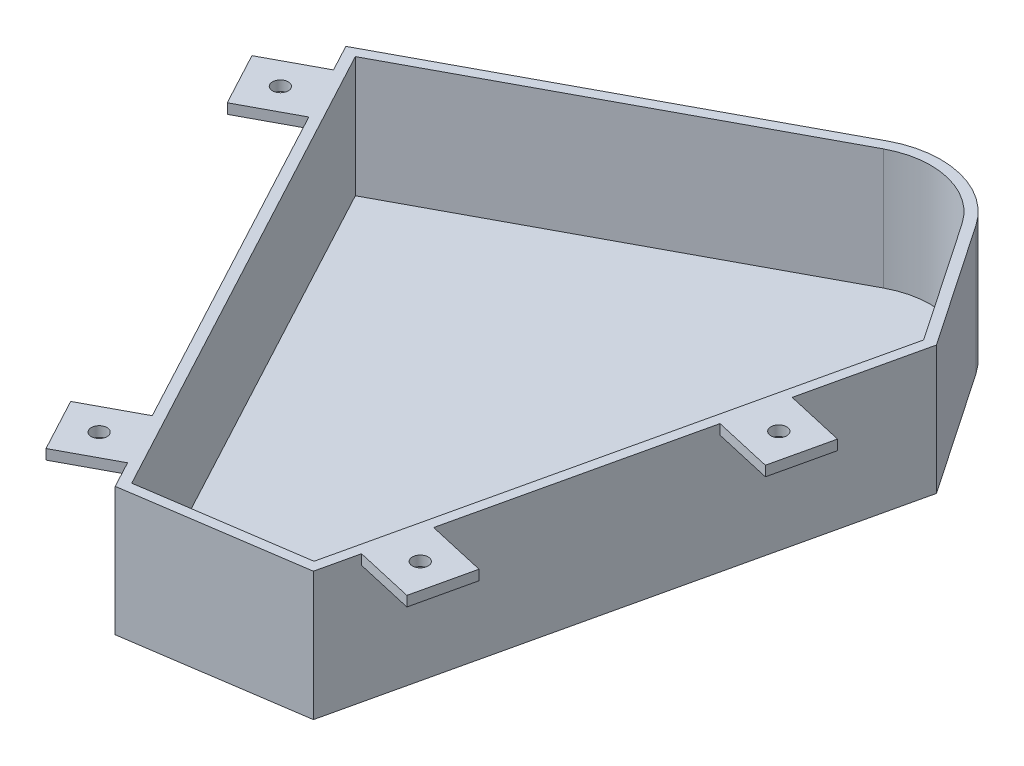
ISO-10303-21;
HEADER;
FILE_DESCRIPTION(('STEP AP214'),'2;1');
FILE_NAME('part.step','',(''),(''),'','','');
FILE_SCHEMA(('AUTOMOTIVE_DESIGN { 1 0 10303 214 1 1 1 1 }'));
ENDSEC;
DATA;
#1=APPLICATION_CONTEXT('core data for automotive mechanical design processes');
#2=APPLICATION_PROTOCOL_DEFINITION('international standard','automotive_design',2000,#1);
#3=PRODUCT_CONTEXT('',#1,'mechanical');
#4=PRODUCT('Part','Part','',(#3));
#5=PRODUCT_RELATED_PRODUCT_CATEGORY('part','',(#4));
#6=PRODUCT_DEFINITION_FORMATION('','',#4);
#7=PRODUCT_DEFINITION_CONTEXT('part definition',#1,'design');
#8=PRODUCT_DEFINITION('design','',#6,#7);
#9=PRODUCT_DEFINITION_SHAPE('','',#8);
#10=(LENGTH_UNIT() NAMED_UNIT(*) SI_UNIT(.MILLI.,.METRE.));
#11=(NAMED_UNIT(*) PLANE_ANGLE_UNIT() SI_UNIT($,.RADIAN.));
#12=(NAMED_UNIT(*) SI_UNIT($,.STERADIAN.) SOLID_ANGLE_UNIT());
#13=UNCERTAINTY_MEASURE_WITH_UNIT(LENGTH_MEASURE(1.E-05),#10,'distance_accuracy_value','');
#14=(GEOMETRIC_REPRESENTATION_CONTEXT(3) GLOBAL_UNCERTAINTY_ASSIGNED_CONTEXT((#13)) GLOBAL_UNIT_ASSIGNED_CONTEXT((#10,
#11,#12)) REPRESENTATION_CONTEXT('',''));
#15=CARTESIAN_POINT('',(0.,0.,0.));
#16=DIRECTION('',(0.,0.,1.));
#17=DIRECTION('',(1.,0.,0.));
#18=AXIS2_PLACEMENT_3D('',#15,#16,#17);
#19=CARTESIAN_POINT('',(79.6910894565371,-281.142833889522,155.590310015721));
#20=DIRECTION('',(-0.881620360618807,0.,0.471959256443143));
#21=DIRECTION('',(0.471959256443143,0.,0.881620360618807));
#22=AXIS2_PLACEMENT_3D('',#19,#20,#21);
#23=PLANE('',#22);
#24=DIRECTION('',(0.471959256443143,0.,0.881620360618807));
#25=VECTOR('',#24,1.);
#26=CARTESIAN_POINT('',(79.6910894565371,40.64,155.590310015721));
#27=LINE('',#26,#25);
#28=CARTESIAN_POINT('',(75.1956775389162,40.64,147.192876080827));
#29=VERTEX_POINT('',#28);
#30=CARTESIAN_POINT('',(79.6910894565371,40.64,155.590310015721));
#31=VERTEX_POINT('',#30);
#32=EDGE_CURVE('E359',#29,#31,#27,.T.);
#33=ORIENTED_EDGE('',*,*,#32,.F.);
#34=DIRECTION('',(0.,1.,0.));
#35=VECTOR('',#34,1.);
#36=CARTESIAN_POINT('',(75.1956775389161,40.64,147.192876080827));
#37=LINE('',#36,#35);
#38=CARTESIAN_POINT('',(75.1956775389161,37.465,147.192876080827));
#39=VERTEX_POINT('',#38);
#40=EDGE_CURVE('E50',#39,#29,#37,.T.);
#41=ORIENTED_EDGE('',*,*,#40,.F.);
#42=DIRECTION('',(0.471959256443143,0.,0.881620360618807));
#43=VECTOR('',#42,1.);
#44=CARTESIAN_POINT('',(75.1956775389161,37.465,147.192876080827));
#45=LINE('',#44,#43);
#46=CARTESIAN_POINT('',(66.2048537036742,37.465,130.398008211039));
#47=VERTEX_POINT('',#46);
#48=EDGE_CURVE('E240',#47,#39,#45,.T.);
#49=ORIENTED_EDGE('',*,*,#48,.F.);
#50=DIRECTION('',(0.,-1.,0.));
#51=VECTOR('',#50,1.);
#52=CARTESIAN_POINT('',(66.2048537036742,40.64,130.398008211039));
#53=LINE('',#52,#51);
#54=CARTESIAN_POINT('',(66.2048537036742,40.64,130.398008211039));
#55=VERTEX_POINT('',#54);
#56=EDGE_CURVE('E774',#55,#47,#53,.T.);
#57=ORIENTED_EDGE('',*,*,#56,.F.);
#58=CARTESIAN_POINT('',(9.18862046869114,40.64,23.8916277989247));
#59=VERTEX_POINT('',#58);
#60=EDGE_CURVE('E364',#59,#55,#27,.T.);
#61=ORIENTED_EDGE('',*,*,#60,.F.);
#62=DIRECTION('',(0.,1.,0.));
#63=VECTOR('',#62,1.);
#64=CARTESIAN_POINT('',(9.18862046869111,40.64,23.8916277989247));
#65=LINE('',#64,#63);
#66=CARTESIAN_POINT('',(9.18862046869111,37.465,23.8916277989247));
#67=VERTEX_POINT('',#66);
#68=EDGE_CURVE('E256',#67,#59,#65,.T.);
#69=ORIENTED_EDGE('',*,*,#68,.F.);
#70=DIRECTION('',(0.471959256443142,0.,0.881620360618808));
#71=VECTOR('',#70,1.);
#72=CARTESIAN_POINT('',(0.197796633449249,37.465,7.09675992913642));
#73=LINE('',#72,#71);
#74=CARTESIAN_POINT('',(0.197796633449249,37.465,7.09675992913642));
#75=VERTEX_POINT('',#74);
#76=EDGE_CURVE('E246',#75,#67,#73,.T.);
#77=ORIENTED_EDGE('',*,*,#76,.F.);
#78=DIRECTION('',(0.,-1.,0.));
#79=VECTOR('',#78,1.);
#80=CARTESIAN_POINT('',(0.19779663344925,40.64,7.09675992913642));
#81=LINE('',#80,#79);
#82=CARTESIAN_POINT('',(0.19779663344925,40.64,7.09675992913642));
#83=VERTEX_POINT('',#82);
#84=EDGE_CURVE('E243',#83,#75,#81,.T.);
#85=ORIENTED_EDGE('',*,*,#84,.F.);
#86=CARTESIAN_POINT('',(-4.29761528417168,40.64,-1.30067400575773));
#87=VERTEX_POINT('',#86);
#88=EDGE_CURVE('E360',#87,#83,#27,.T.);
#89=ORIENTED_EDGE('',*,*,#88,.F.);
#90=DIRECTION('',(0.,1.,0.));
#91=VECTOR('',#90,1.);
#92=CARTESIAN_POINT('',(-4.29761528417168,-281.142833889522,-1.30067400575773));
#93=LINE('',#92,#91);
#94=CARTESIAN_POINT('',(-4.29761528417168,0.,-1.30067400575773));
#95=VERTEX_POINT('',#94);
#96=EDGE_CURVE('E393',#95,#87,#93,.T.);
#97=ORIENTED_EDGE('',*,*,#96,.F.);
#98=DIRECTION('',(-0.471959256443143,0.,-0.881620360618807));
#99=VECTOR('',#98,1.);
#100=CARTESIAN_POINT('',(79.6910894565371,0.,155.590310015721));
#101=LINE('',#100,#99);
#102=CARTESIAN_POINT('',(79.6910894565371,0.,155.590310015721));
#103=VERTEX_POINT('',#102);
#104=EDGE_CURVE('E376',#103,#95,#101,.T.);
#105=ORIENTED_EDGE('',*,*,#104,.F.);
#106=DIRECTION('',(0.,1.,0.));
#107=VECTOR('',#106,1.);
#108=CARTESIAN_POINT('',(79.6910894565371,-281.142833889522,155.590310015721));
#109=LINE('',#108,#107);
#110=EDGE_CURVE('E372',#103,#31,#109,.T.);
#111=ORIENTED_EDGE('',*,*,#110,.T.);
#112=EDGE_LOOP('',(#33,#41,#49,#57,#61,#69,#77,#85,#89,#97,#105,#111));
#113=FACE_BOUND('',#112,.T.);
#114=ADVANCED_FACE('F35',(#113),#23,.T.);
#115=CARTESIAN_POINT('',(170.799497483055,-281.142833889522,-12.8953047442904));
#116=DIRECTION('',(0.975001962576884,0.,0.222196248778473));
#117=DIRECTION('',(0.222196248778473,0.,-0.975001962576884));
#118=AXIS2_PLACEMENT_3D('',#115,#116,#117);
#119=PLANE('',#118);
#120=DIRECTION('',(0.222196248778473,0.,-0.975001962576884));
#121=VECTOR('',#120,1.);
#122=CARTESIAN_POINT('',(170.799497483055,40.64,-12.8953047442904));
#123=LINE('',#122,#121);
#124=CARTESIAN_POINT('',(141.301647358276,40.64,116.541901876294));
#125=VERTEX_POINT('',#124);
#126=CARTESIAN_POINT('',(158.100981865365,40.64,42.8260574169785));
#127=VERTEX_POINT('',#126);
#128=EDGE_CURVE('E350',#125,#127,#123,.T.);
#129=ORIENTED_EDGE('',*,*,#128,.F.);
#130=DIRECTION('',(0.,1.,0.));
#131=VECTOR('',#130,1.);
#132=CARTESIAN_POINT('',(141.301647358276,40.64,116.541901876294));
#133=LINE('',#132,#131);
#134=CARTESIAN_POINT('',(141.301647358276,37.465,116.541901876294));
#135=VERTEX_POINT('',#134);
#136=EDGE_CURVE('E272',#135,#125,#133,.T.);
#137=ORIENTED_EDGE('',*,*,#136,.F.);
#138=DIRECTION('',(0.222196248778474,0.,-0.975001962576884));
#139=VECTOR('',#138,1.);
#140=CARTESIAN_POINT('',(141.301647358276,37.465,116.541901876294));
#141=LINE('',#140,#139);
#142=CARTESIAN_POINT('',(137.068808819046,37.465,135.115689263384));
#143=VERTEX_POINT('',#142);
#144=EDGE_CURVE('E277',#143,#135,#141,.T.);
#145=ORIENTED_EDGE('',*,*,#144,.F.);
#146=DIRECTION('',(0.,-1.,0.));
#147=VECTOR('',#146,1.);
#148=CARTESIAN_POINT('',(137.068808819046,40.64,135.115689263384));
#149=LINE('',#148,#147);
#150=CARTESIAN_POINT('',(137.068808819046,40.64,135.115689263384));
#151=VERTEX_POINT('',#150);
#152=EDGE_CURVE('E285',#151,#143,#149,.T.);
#153=ORIENTED_EDGE('',*,*,#152,.F.);
#154=CARTESIAN_POINT('',(134.24691645956,40.64,147.49821418811));
#155=VERTEX_POINT('',#154);
#156=EDGE_CURVE('E346',#155,#151,#123,.T.);
#157=ORIENTED_EDGE('',*,*,#156,.F.);
#158=DIRECTION('',(0.,1.,0.));
#159=VECTOR('',#158,1.);
#160=CARTESIAN_POINT('',(134.24691645956,-281.142833889522,147.49821418811));
#161=LINE('',#160,#159);
#162=CARTESIAN_POINT('',(134.24691645956,0.,147.49821418811));
#163=VERTEX_POINT('',#162);
#164=EDGE_CURVE('E381',#163,#155,#161,.T.);
#165=ORIENTED_EDGE('',*,*,#164,.F.);
#166=DIRECTION('',(-0.222196248778473,0.,0.975001962576884));
#167=VECTOR('',#166,1.);
#168=CARTESIAN_POINT('',(170.799497483055,0.,-12.8953047442904));
#169=LINE('',#168,#167);
#170=CARTESIAN_POINT('',(170.799497483055,0.,-12.8953047442904));
#171=VERTEX_POINT('',#170);
#172=EDGE_CURVE('E365',#171,#163,#169,.T.);
#173=ORIENTED_EDGE('',*,*,#172,.F.);
#174=DIRECTION('',(0.,1.,0.));
#175=VECTOR('',#174,1.);
#176=CARTESIAN_POINT('',(170.799497483055,-281.142833889522,-12.8953047442904));
#177=LINE('',#176,#175);
#178=CARTESIAN_POINT('',(170.799497483055,40.64,-12.8953047442904));
#179=VERTEX_POINT('',#178);
#180=EDGE_CURVE('E399',#171,#179,#177,.T.);
#181=ORIENTED_EDGE('',*,*,#180,.T.);
#182=CARTESIAN_POINT('',(162.333820404595,40.64,24.2522700298888));
#183=VERTEX_POINT('',#182);
#184=EDGE_CURVE('E345',#183,#179,#123,.T.);
#185=ORIENTED_EDGE('',*,*,#184,.F.);
#186=DIRECTION('',(0.,1.,0.));
#187=VECTOR('',#186,1.);
#188=CARTESIAN_POINT('',(162.333820404595,40.64,24.2522700298888));
#189=LINE('',#188,#187);
#190=CARTESIAN_POINT('',(162.333820404595,37.465,24.2522700298888));
#191=VERTEX_POINT('',#190);
#192=EDGE_CURVE('E303',#191,#183,#189,.T.);
#193=ORIENTED_EDGE('',*,*,#192,.F.);
#194=DIRECTION('',(0.222196248778472,0.,-0.975001962576884));
#195=VECTOR('',#194,1.);
#196=CARTESIAN_POINT('',(158.100981865365,37.465,42.8260574169785));
#197=LINE('',#196,#195);
#198=CARTESIAN_POINT('',(158.100981865365,37.465,42.8260574169785));
#199=VERTEX_POINT('',#198);
#200=EDGE_CURVE('E312',#199,#191,#197,.T.);
#201=ORIENTED_EDGE('',*,*,#200,.F.);
#202=DIRECTION('',(0.,-1.,0.));
#203=VECTOR('',#202,1.);
#204=CARTESIAN_POINT('',(158.100981865365,40.64,42.8260574169785));
#205=LINE('',#204,#203);
#206=EDGE_CURVE('E298',#127,#199,#205,.T.);
#207=ORIENTED_EDGE('',*,*,#206,.F.);
#208=EDGE_LOOP('',(#129,#137,#145,#153,#157,#165,#173,#181,#185,#193,#201,#207));
#209=FACE_BOUND('',#208,.T.);
#210=ADVANCED_FACE('F455',(#209),#119,.T.);
#211=CARTESIAN_POINT('',(120.68226520754,2.54,-35.7944457306716));
#212=DIRECTION('',(0.,1.,0.));
#213=DIRECTION('',(0.,0.,1.));
#214=AXIS2_PLACEMENT_3D('',#211,#212,#213);
#215=PLANE('',#214);
#216=CARTESIAN_POINT('',(120.68226520754,2.54,-35.7944457306716));
#217=DIRECTION('',(0.,1.,0.));
#218=DIRECTION('',(0.,0.,1.));
#219=AXIS2_PLACEMENT_3D('',#216,#217,#218);
#220=CIRCLE('',#219,25.4);
#221=CARTESIAN_POINT('',(141.688668345022,2.53999999999999,-50.0734872680284));
#222=VERTEX_POINT('',#221);
#223=CARTESIAN_POINT('',(108.694500093884,2.53999999999999,-58.1876028903893));
#224=VERTEX_POINT('',#223);
#225=EDGE_CURVE('E367',#222,#224,#220,.T.);
#226=ORIENTED_EDGE('',*,*,#225,.T.);
#227=DIRECTION('',(-0.881620360618805,0.,0.471959256443146));
#228=VECTOR('',#227,1.);
#229=CARTESIAN_POINT('',(108.694500093884,2.54,-58.1876028903893));
#230=LINE('',#229,#228);
#231=CARTESIAN_POINT('',(0.,2.53999999999999,0.));
#232=VERTEX_POINT('',#231);
#233=EDGE_CURVE('E405',#224,#232,#230,.T.);
#234=ORIENTED_EDGE('',*,*,#233,.T.);
#235=DIRECTION('',(0.471959256443143,0.,0.881620360618807));
#236=VECTOR('',#235,1.);
#237=CARTESIAN_POINT('',(81.4356168735111,2.54,152.12181334532));
#238=LINE('',#237,#236);
#239=CARTESIAN_POINT('',(81.4356168735111,2.53999999999999,152.12181334532));
#240=VERTEX_POINT('',#239);
#241=EDGE_CURVE('E408',#232,#240,#238,.T.);
#242=ORIENTED_EDGE('',*,*,#241,.T.);
#243=DIRECTION('',(0.989177816923859,0.,-0.146721663382569));
#244=VECTOR('',#243,1.);
#245=CARTESIAN_POINT('',(81.4356168735111,2.54,152.12181334532));
#246=LINE('',#245,#244);
#247=CARTESIAN_POINT('',(131.633654364796,2.54,144.676094857449));
#248=VERTEX_POINT('',#247);
#249=EDGE_CURVE('E411',#240,#248,#246,.T.);
#250=ORIENTED_EDGE('',*,*,#249,.T.);
#251=DIRECTION('',(0.222196248778473,0.,-0.975001962576884));
#252=VECTOR('',#251,1.);
#253=CARTESIAN_POINT('',(131.633654364796,2.54,144.676094857449));
#254=LINE('',#253,#252);
#255=CARTESIAN_POINT('',(167.396796738436,2.53999999999999,-12.2533501440229));
#256=VERTEX_POINT('',#255);
#257=EDGE_CURVE('E43',#248,#256,#254,.T.);
#258=ORIENTED_EDGE('',*,*,#257,.T.);
#259=DIRECTION('',(-0.56216698965972,0.,-0.827023745570179));
#260=VECTOR('',#259,1.);
#261=CARTESIAN_POINT('',(167.396796738436,2.54,-12.2533501440229));
#262=LINE('',#261,#260);
#263=EDGE_CURVE('E11',#256,#222,#262,.T.);
#264=ORIENTED_EDGE('',*,*,#263,.T.);
#265=EDGE_LOOP('',(#226,#234,#242,#250,#258,#264));
#266=FACE_BOUND('',#265,.T.);
#267=ADVANCED_FACE('F416',(#266),#215,.T.);
#268=CARTESIAN_POINT('',(144.314468737207,-281.142833889522,-51.8583674601981));
#269=DIRECTION('',(0.827023745570179,0.,-0.562166989659719));
#270=DIRECTION('',(-0.562166989659719,0.,-0.82702374557018));
#271=AXIS2_PLACEMENT_3D('',#268,#269,#270);
#272=PLANE('',#271);
#273=DIRECTION('',(0.562166989659719,0.,0.82702374557018));
#274=VECTOR('',#273,1.);
#275=CARTESIAN_POINT('',(144.314468737207,0.,-51.8583674601981));
#276=LINE('',#275,#274);
#277=CARTESIAN_POINT('',(144.314468737207,0.,-51.8583674601981));
#278=VERTEX_POINT('',#277);
#279=EDGE_CURVE('E369',#278,#171,#276,.T.);
#280=ORIENTED_EDGE('',*,*,#279,.F.);
#281=DIRECTION('',(0.,1.,0.));
#282=VECTOR('',#281,1.);
#283=CARTESIAN_POINT('',(144.314468737207,-281.142833889522,-51.8583674601981));
#284=LINE('',#283,#282);
#285=CARTESIAN_POINT('',(144.314468737207,40.64,-51.8583674601981));
#286=VERTEX_POINT('',#285);
#287=EDGE_CURVE('E397',#278,#286,#284,.T.);
#288=ORIENTED_EDGE('',*,*,#287,.T.);
#289=DIRECTION('',(-0.562166989659719,0.,-0.827023745570179));
#290=VECTOR('',#289,1.);
#291=CARTESIAN_POINT('',(144.314468737207,40.64,-51.8583674601981));
#292=LINE('',#291,#290);
#293=EDGE_CURVE('E349',#179,#286,#292,.T.);
#294=ORIENTED_EDGE('',*,*,#293,.F.);
#295=ORIENTED_EDGE('',*,*,#180,.F.);
#296=EDGE_LOOP('',(#280,#288,#294,#295));
#297=FACE_BOUND('',#296,.T.);
#298=ADVANCED_FACE('F473',(#297),#272,.T.);
#299=CARTESIAN_POINT('',(120.68226520754,-281.142833889522,-35.7944457306715));
#300=DIRECTION('',(0.,1.,0.));
#301=DIRECTION('',(0.,0.,1.));
#302=AXIS2_PLACEMENT_3D('',#299,#300,#301);
#303=CYLINDRICAL_SURFACE('',#302,28.5750000000001);
#304=CARTESIAN_POINT('',(120.68226520754,0.,-35.7944457306715));
#305=DIRECTION('',(0.,1.,0.));
#306=DIRECTION('',(0.,0.,1.));
#307=AXIS2_PLACEMENT_3D('',#304,#305,#306);
#308=CIRCLE('',#307,28.5750000000001);
#309=CARTESIAN_POINT('',(107.196029454677,0.,-60.986747535354));
#310=VERTEX_POINT('',#309);
#311=EDGE_CURVE('E371',#310,#278,#308,.F.);
#312=ORIENTED_EDGE('',*,*,#311,.F.);
#313=DIRECTION('',(0.,1.,0.));
#314=VECTOR('',#313,1.);
#315=CARTESIAN_POINT('',(107.196029454677,-281.142833889522,-60.986747535354));
#316=LINE('',#315,#314);
#317=CARTESIAN_POINT('',(107.196029454677,40.64,-60.986747535354));
#318=VERTEX_POINT('',#317);
#319=EDGE_CURVE('E395',#310,#318,#316,.T.);
#320=ORIENTED_EDGE('',*,*,#319,.T.);
#321=CARTESIAN_POINT('',(120.68226520754,40.64,-35.7944457306715));
#322=DIRECTION('',(0.,1.,0.));
#323=DIRECTION('',(0.,0.,-1.));
#324=AXIS2_PLACEMENT_3D('',#321,#322,#323);
#325=CIRCLE('',#324,28.5750000000001);
#326=EDGE_CURVE('E353',#286,#318,#325,.T.);
#327=ORIENTED_EDGE('',*,*,#326,.F.);
#328=ORIENTED_EDGE('',*,*,#287,.F.);
#329=EDGE_LOOP('',(#312,#320,#327,#328));
#330=FACE_BOUND('',#329,.T.);
#331=ADVANCED_FACE('F469',(#330),#303,.T.);
#332=CARTESIAN_POINT('',(-4.29761528417168,-281.142833889522,-1.30067400575773));
#333=DIRECTION('',(-0.471959256443146,0.,-0.881620360618805));
#334=DIRECTION('',(-0.881620360618806,0.,0.471959256443146));
#335=AXIS2_PLACEMENT_3D('',#332,#333,#334);
#336=PLANE('',#335);
#337=DIRECTION('',(0.881620360618806,0.,-0.471959256443146));
#338=VECTOR('',#337,1.);
#339=CARTESIAN_POINT('',(-4.29761528417168,0.,-1.30067400575773));
#340=LINE('',#339,#338);
#341=EDGE_CURVE('E374',#95,#310,#340,.T.);
#342=ORIENTED_EDGE('',*,*,#341,.F.);
#343=ORIENTED_EDGE('',*,*,#96,.T.);
#344=DIRECTION('',(-0.881620360618805,0.,0.471959256443146));
#345=VECTOR('',#344,1.);
#346=CARTESIAN_POINT('',(-4.29761528417168,40.64,-1.30067400575773));
#347=LINE('',#346,#345);
#348=EDGE_CURVE('E356',#318,#87,#347,.T.);
#349=ORIENTED_EDGE('',*,*,#348,.F.);
#350=ORIENTED_EDGE('',*,*,#319,.F.);
#351=EDGE_LOOP('',(#342,#343,#349,#350));
#352=FACE_BOUND('',#351,.T.);
#353=ADVANCED_FACE('F465',(#352),#336,.T.);
#354=CARTESIAN_POINT('',(134.24691645956,-281.142833889522,147.49821418811));
#355=DIRECTION('',(0.146721663382569,0.,0.989177816923859));
#356=DIRECTION('',(0.989177816923859,0.,-0.146721663382569));
#357=AXIS2_PLACEMENT_3D('',#354,#355,#356);
#358=PLANE('',#357);
#359=DIRECTION('',(-0.989177816923859,0.,0.146721663382569));
#360=VECTOR('',#359,1.);
#361=CARTESIAN_POINT('',(134.24691645956,0.,147.49821418811));
#362=LINE('',#361,#360);
#363=EDGE_CURVE('E368',#163,#103,#362,.T.);
#364=ORIENTED_EDGE('',*,*,#363,.F.);
#365=ORIENTED_EDGE('',*,*,#164,.T.);
#366=DIRECTION('',(0.989177816923859,0.,-0.146721663382569));
#367=VECTOR('',#366,1.);
#368=CARTESIAN_POINT('',(134.24691645956,40.64,147.49821418811));
#369=LINE('',#368,#367);
#370=EDGE_CURVE('E343',#31,#155,#369,.T.);
#371=ORIENTED_EDGE('',*,*,#370,.F.);
#372=ORIENTED_EDGE('',*,*,#110,.F.);
#373=EDGE_LOOP('',(#364,#365,#371,#372));
#374=FACE_BOUND('',#373,.T.);
#375=ADVANCED_FACE('F468',(#374),#358,.T.);
#376=CARTESIAN_POINT('',(167.396796738436,-281.142833889522,-12.2533501440229));
#377=DIRECTION('',(0.975001962576884,0.,0.222196248778473));
#378=DIRECTION('',(0.222196248778473,0.,-0.975001962576884));
#379=AXIS2_PLACEMENT_3D('',#376,#377,#378);
#380=PLANE('',#379);
#381=ORIENTED_EDGE('',*,*,#257,.F.);
#382=DIRECTION('',(0.,1.,0.));
#383=VECTOR('',#382,1.);
#384=CARTESIAN_POINT('',(131.633654364796,-281.142833889522,144.676094857449));
#385=LINE('',#384,#383);
#386=CARTESIAN_POINT('',(131.633654364796,40.64,144.676094857449));
#387=VERTEX_POINT('',#386);
#388=EDGE_CURVE('E363',#248,#387,#385,.T.);
#389=ORIENTED_EDGE('',*,*,#388,.T.);
#390=DIRECTION('',(0.222196248778473,0.,-0.975001962576884));
#391=VECTOR('',#390,1.);
#392=CARTESIAN_POINT('',(167.396796738436,40.64,-12.2533501440229));
#393=LINE('',#392,#391);
#394=CARTESIAN_POINT('',(167.396796738436,40.64,-12.2533501440229));
#395=VERTEX_POINT('',#394);
#396=EDGE_CURVE('E328',#387,#395,#393,.T.);
#397=ORIENTED_EDGE('',*,*,#396,.T.);
#398=DIRECTION('',(0.,1.,0.));
#399=VECTOR('',#398,1.);
#400=CARTESIAN_POINT('',(167.396796738436,-281.142833889522,-12.2533501440229));
#401=LINE('',#400,#399);
#402=EDGE_CURVE('E388',#256,#395,#401,.T.);
#403=ORIENTED_EDGE('',*,*,#402,.F.);
#404=EDGE_LOOP('',(#381,#389,#397,#403));
#405=FACE_BOUND('',#404,.T.);
#406=ADVANCED_FACE('F419',(#405),#380,.F.);
#407=CARTESIAN_POINT('',(141.688668345022,-281.142833889522,-50.0734872680284));
#408=DIRECTION('',(0.827023745570179,0.,-0.56216698965972));
#409=DIRECTION('',(-0.56216698965972,0.,-0.827023745570179));
#410=AXIS2_PLACEMENT_3D('',#407,#408,#409);
#411=PLANE('',#410);
#412=ORIENTED_EDGE('',*,*,#263,.F.);
#413=ORIENTED_EDGE('',*,*,#402,.T.);
#414=DIRECTION('',(-0.56216698965972,0.,-0.827023745570179));
#415=VECTOR('',#414,1.);
#416=CARTESIAN_POINT('',(141.688668345022,40.64,-50.0734872680284));
#417=LINE('',#416,#415);
#418=CARTESIAN_POINT('',(141.688668345022,40.64,-50.0734872680284));
#419=VERTEX_POINT('',#418);
#420=EDGE_CURVE('E331',#395,#419,#417,.T.);
#421=ORIENTED_EDGE('',*,*,#420,.T.);
#422=DIRECTION('',(0.,1.,0.));
#423=VECTOR('',#422,1.);
#424=CARTESIAN_POINT('',(141.688668345022,-281.142833889522,-50.0734872680284));
#425=LINE('',#424,#423);
#426=EDGE_CURVE('E386',#222,#419,#425,.T.);
#427=ORIENTED_EDGE('',*,*,#426,.F.);
#428=EDGE_LOOP('',(#412,#413,#421,#427));
#429=FACE_BOUND('',#428,.T.);
#430=ADVANCED_FACE('F423',(#429),#411,.F.);
#431=CARTESIAN_POINT('',(120.68226520754,-281.142833889522,-35.7944457306715));
#432=DIRECTION('',(0.,1.,0.));
#433=DIRECTION('',(0.,0.,1.));
#434=AXIS2_PLACEMENT_3D('',#431,#432,#433);
#435=CYLINDRICAL_SURFACE('',#434,25.4000000000001);
#436=ORIENTED_EDGE('',*,*,#225,.F.);
#437=ORIENTED_EDGE('',*,*,#426,.T.);
#438=CARTESIAN_POINT('',(120.68226520754,40.64,-35.7944457306715));
#439=DIRECTION('',(0.,1.,0.));
#440=DIRECTION('',(0.,0.,-1.));
#441=AXIS2_PLACEMENT_3D('',#438,#439,#440);
#442=CIRCLE('',#441,25.4000000000001);
#443=CARTESIAN_POINT('',(108.694500093884,40.64,-58.1876028903893));
#444=VERTEX_POINT('',#443);
#445=EDGE_CURVE('E334',#419,#444,#442,.T.);
#446=ORIENTED_EDGE('',*,*,#445,.T.);
#447=DIRECTION('',(0.,1.,0.));
#448=VECTOR('',#447,1.);
#449=CARTESIAN_POINT('',(108.694500093884,-281.142833889522,-58.1876028903893));
#450=LINE('',#449,#448);
#451=EDGE_CURVE('E384',#224,#444,#450,.T.);
#452=ORIENTED_EDGE('',*,*,#451,.F.);
#453=EDGE_LOOP('',(#436,#437,#446,#452));
#454=FACE_BOUND('',#453,.T.);
#455=ADVANCED_FACE('F427',(#454),#435,.F.);
#456=CARTESIAN_POINT('',(0.,-281.142833889522,0.));
#457=DIRECTION('',(-0.471959256443146,0.,-0.881620360618805));
#458=DIRECTION('',(-0.881620360618806,0.,0.471959256443146));
#459=AXIS2_PLACEMENT_3D('',#456,#457,#458);
#460=PLANE('',#459);
#461=ORIENTED_EDGE('',*,*,#233,.F.);
#462=ORIENTED_EDGE('',*,*,#451,.T.);
#463=DIRECTION('',(-0.881620360618805,0.,0.471959256443146));
#464=VECTOR('',#463,1.);
#465=CARTESIAN_POINT('',(0.,40.64,0.));
#466=LINE('',#465,#464);
#467=CARTESIAN_POINT('',(0.,40.64,0.));
#468=VERTEX_POINT('',#467);
#469=EDGE_CURVE('E337',#444,#468,#466,.T.);
#470=ORIENTED_EDGE('',*,*,#469,.T.);
#471=DIRECTION('',(0.,1.,0.));
#472=VECTOR('',#471,1.);
#473=CARTESIAN_POINT('',(0.,-281.142833889522,0.));
#474=LINE('',#473,#472);
#475=EDGE_CURVE('E382',#232,#468,#474,.T.);
#476=ORIENTED_EDGE('',*,*,#475,.F.);
#477=EDGE_LOOP('',(#461,#462,#470,#476));
#478=FACE_BOUND('',#477,.T.);
#479=ADVANCED_FACE('F432',(#478),#460,.F.);
#480=CARTESIAN_POINT('',(81.4356168735111,-281.142833889522,152.12181334532));
#481=DIRECTION('',(-0.881620360618807,0.,0.471959256443143));
#482=DIRECTION('',(0.471959256443143,0.,0.881620360618807));
#483=AXIS2_PLACEMENT_3D('',#480,#481,#482);
#484=PLANE('',#483);
#485=ORIENTED_EDGE('',*,*,#241,.F.);
#486=ORIENTED_EDGE('',*,*,#475,.T.);
#487=DIRECTION('',(0.471959256443143,0.,0.881620360618807));
#488=VECTOR('',#487,1.);
#489=CARTESIAN_POINT('',(81.4356168735111,40.64,152.12181334532));
#490=LINE('',#489,#488);
#491=CARTESIAN_POINT('',(81.4356168735111,40.64,152.12181334532));
#492=VERTEX_POINT('',#491);
#493=EDGE_CURVE('E340',#468,#492,#490,.T.);
#494=ORIENTED_EDGE('',*,*,#493,.T.);
#495=DIRECTION('',(0.,1.,0.));
#496=VECTOR('',#495,1.);
#497=CARTESIAN_POINT('',(81.4356168735111,-281.142833889522,152.12181334532));
#498=LINE('',#497,#496);
#499=EDGE_CURVE('E379',#240,#492,#498,.T.);
#500=ORIENTED_EDGE('',*,*,#499,.F.);
#501=EDGE_LOOP('',(#485,#486,#494,#500));
#502=FACE_BOUND('',#501,.T.);
#503=ADVANCED_FACE('F435',(#502),#484,.F.);
#504=CARTESIAN_POINT('',(81.4356168735111,-281.142833889522,152.12181334532));
#505=DIRECTION('',(0.146721663382569,0.,0.989177816923859));
#506=DIRECTION('',(0.989177816923859,0.,-0.146721663382569));
#507=AXIS2_PLACEMENT_3D('',#504,#505,#506);
#508=PLANE('',#507);
#509=ORIENTED_EDGE('',*,*,#249,.F.);
#510=ORIENTED_EDGE('',*,*,#499,.T.);
#511=DIRECTION('',(0.989177816923859,0.,-0.146721663382569));
#512=VECTOR('',#511,1.);
#513=CARTESIAN_POINT('',(81.4356168735111,40.64,152.12181334532));
#514=LINE('',#513,#512);
#515=EDGE_CURVE('E325',#492,#387,#514,.T.);
#516=ORIENTED_EDGE('',*,*,#515,.T.);
#517=ORIENTED_EDGE('',*,*,#388,.F.);
#518=EDGE_LOOP('',(#509,#510,#516,#517));
#519=FACE_BOUND('',#518,.T.);
#520=ADVANCED_FACE('F439',(#519),#508,.F.);
#521=CARTESIAN_POINT('',(120.68226520754,40.64,-35.7944457306715));
#522=DIRECTION('',(0.,-1.,0.));
#523=DIRECTION('',(0.,0.,-1.));
#524=AXIS2_PLACEMENT_3D('',#521,#522,#523);
#525=PLANE('',#524);
#526=CARTESIAN_POINT('',(-3.7042253838239,40.64,19.9896057816515));
#527=DIRECTION('',(0.,-1.,0.));
#528=DIRECTION('',(0.,0.,-1.));
#529=AXIS2_PLACEMENT_3D('',#526,#527,#528);
#530=CIRCLE('',#529,2.4892);
#531=CARTESIAN_POINT('',(-3.7042253838239,40.64,17.5004057816515));
#532=VERTEX_POINT('',#531);
#533=EDGE_CURVE('E775',#532,#532,#530,.F.);
#534=ORIENTED_EDGE('',*,*,#533,.F.);
#535=EDGE_LOOP('',(#534));
#536=FACE_BOUND('',#535,.T.);
#537=CARTESIAN_POINT('',(62.3028316864009,40.64,143.290854063554));
#538=DIRECTION('',(0.,-1.,0.));
#539=DIRECTION('',(0.,0.,-1.));
#540=AXIS2_PLACEMENT_3D('',#537,#538,#539);
#541=CIRCLE('',#540,2.4892);
#542=CARTESIAN_POINT('',(62.3028316864009,40.64,140.801654063554));
#543=VERTEX_POINT('',#542);
#544=EDGE_CURVE('E840',#543,#543,#541,.F.);
#545=ORIENTED_EDGE('',*,*,#544,.F.);
#546=EDGE_LOOP('',(#545));
#547=FACE_BOUND('',#546,.T.);
#548=CARTESIAN_POINT('',(148.472121782206,40.64,127.945214839454));
#549=DIRECTION('',(0.,-1.,0.));
#550=DIRECTION('',(0.,0.,-1.));
#551=AXIS2_PLACEMENT_3D('',#548,#549,#550);
#552=CIRCLE('',#551,2.48920000000001);
#553=CARTESIAN_POINT('',(148.472121782206,40.64,125.456014839454));
#554=VERTEX_POINT('',#553);
#555=EDGE_CURVE('E765',#554,#554,#552,.F.);
#556=ORIENTED_EDGE('',*,*,#555,.F.);
#557=EDGE_LOOP('',(#556));
#558=FACE_BOUND('',#557,.T.);
#559=CARTESIAN_POINT('',(169.504294828525,40.64,35.6555829930486));
#560=DIRECTION('',(0.,-1.,0.));
#561=DIRECTION('',(0.,0.,-1.));
#562=AXIS2_PLACEMENT_3D('',#559,#560,#561);
#563=CIRCLE('',#562,2.4892);
#564=CARTESIAN_POINT('',(169.504294828525,40.64,33.1663829930486));
#565=VERTEX_POINT('',#564);
#566=EDGE_CURVE('E760',#565,#565,#563,.F.);
#567=ORIENTED_EDGE('',*,*,#566,.F.);
#568=EDGE_LOOP('',(#567));
#569=FACE_BOUND('',#568,.T.);
#570=ORIENTED_EDGE('',*,*,#370,.T.);
#571=ORIENTED_EDGE('',*,*,#156,.T.);
#572=DIRECTION('',(-0.975001962576884,0.,-0.222196248778473));
#573=VECTOR('',#572,1.);
#574=CARTESIAN_POINT('',(155.642596206136,40.64,139.348527802613));
#575=LINE('',#574,#573);
#576=CARTESIAN_POINT('',(155.642596206136,40.64,139.348527802613));
#577=VERTEX_POINT('',#576);
#578=EDGE_CURVE('E293',#577,#151,#575,.T.);
#579=ORIENTED_EDGE('',*,*,#578,.F.);
#580=DIRECTION('',(-0.222196248778474,0.,0.975001962576884));
#581=VECTOR('',#580,1.);
#582=CARTESIAN_POINT('',(159.875434745366,40.64,120.774740415524));
#583=LINE('',#582,#581);
#584=CARTESIAN_POINT('',(159.875434745366,40.64,120.774740415524));
#585=VERTEX_POINT('',#584);
#586=EDGE_CURVE('E276',#585,#577,#583,.T.);
#587=ORIENTED_EDGE('',*,*,#586,.F.);
#588=DIRECTION('',(-0.975001962576884,0.,-0.222196248778473));
#589=VECTOR('',#588,1.);
#590=CARTESIAN_POINT('',(159.875434745366,40.64,120.774740415524));
#591=LINE('',#590,#589);
#592=EDGE_CURVE('E295',#585,#125,#591,.T.);
#593=ORIENTED_EDGE('',*,*,#592,.T.);
#594=ORIENTED_EDGE('',*,*,#128,.T.);
#595=DIRECTION('',(-0.975001962576884,0.,-0.222196248778473));
#596=VECTOR('',#595,1.);
#597=CARTESIAN_POINT('',(176.674769252455,40.64,47.0588959562084));
#598=LINE('',#597,#596);
#599=CARTESIAN_POINT('',(176.674769252455,40.64,47.0588959562084));
#600=VERTEX_POINT('',#599);
#601=EDGE_CURVE('E309',#600,#127,#598,.T.);
#602=ORIENTED_EDGE('',*,*,#601,.F.);
#603=DIRECTION('',(-0.222196248778472,0.,0.975001962576884));
#604=VECTOR('',#603,1.);
#605=CARTESIAN_POINT('',(176.674769252455,40.64,47.0588959562084));
#606=LINE('',#605,#604);
#607=CARTESIAN_POINT('',(180.907607791685,40.64,28.4851085691188));
#608=VERTEX_POINT('',#607);
#609=EDGE_CURVE('E307',#608,#600,#606,.T.);
#610=ORIENTED_EDGE('',*,*,#609,.F.);
#611=DIRECTION('',(-0.975001962576884,0.,-0.222196248778473));
#612=VECTOR('',#611,1.);
#613=CARTESIAN_POINT('',(180.907607791685,40.64,28.4851085691188));
#614=LINE('',#613,#612);
#615=EDGE_CURVE('E318',#608,#183,#614,.T.);
#616=ORIENTED_EDGE('',*,*,#615,.T.);
#617=ORIENTED_EDGE('',*,*,#184,.T.);
#618=ORIENTED_EDGE('',*,*,#293,.T.);
#619=ORIENTED_EDGE('',*,*,#326,.T.);
#620=ORIENTED_EDGE('',*,*,#348,.T.);
#621=ORIENTED_EDGE('',*,*,#88,.T.);
#622=DIRECTION('',(0.881620360618808,0.,-0.471959256443142));
#623=VECTOR('',#622,1.);
#624=CARTESIAN_POINT('',(-16.597071236339,40.64,16.0875837643783));
#625=LINE('',#624,#623);
#626=CARTESIAN_POINT('',(-16.597071236339,40.64,16.0875837643783));
#627=VERTEX_POINT('',#626);
#628=EDGE_CURVE('E261',#627,#83,#625,.T.);
#629=ORIENTED_EDGE('',*,*,#628,.F.);
#630=DIRECTION('',(-0.471959256443142,0.,-0.881620360618808));
#631=VECTOR('',#630,1.);
#632=CARTESIAN_POINT('',(-16.597071236339,40.64,16.0875837643783));
#633=LINE('',#632,#631);
#634=CARTESIAN_POINT('',(-7.60624740109718,40.64,32.8824516341666));
#635=VERTEX_POINT('',#634);
#636=EDGE_CURVE('E260',#635,#627,#633,.T.);
#637=ORIENTED_EDGE('',*,*,#636,.F.);
#638=DIRECTION('',(0.881620360618808,0.,-0.471959256443142));
#639=VECTOR('',#638,1.);
#640=CARTESIAN_POINT('',(-7.60624740109718,40.64,32.8824516341666));
#641=LINE('',#640,#639);
#642=EDGE_CURVE('E58',#635,#59,#641,.T.);
#643=ORIENTED_EDGE('',*,*,#642,.T.);
#644=ORIENTED_EDGE('',*,*,#60,.T.);
#645=DIRECTION('',(0.881620360618808,0.,-0.471959256443142));
#646=VECTOR('',#645,1.);
#647=CARTESIAN_POINT('',(49.4099858338859,40.64,139.388832046281));
#648=LINE('',#647,#646);
#649=CARTESIAN_POINT('',(49.4099858338859,40.64,139.388832046281));
#650=VERTEX_POINT('',#649);
#651=EDGE_CURVE('E229',#650,#55,#648,.T.);
#652=ORIENTED_EDGE('',*,*,#651,.F.);
#653=DIRECTION('',(-0.471959256443143,0.,-0.881620360618807));
#654=VECTOR('',#653,1.);
#655=CARTESIAN_POINT('',(58.4008096691278,40.64,156.183699916069));
#656=LINE('',#655,#654);
#657=CARTESIAN_POINT('',(58.4008096691278,40.64,156.183699916069));
#658=VERTEX_POINT('',#657);
#659=EDGE_CURVE('E222',#658,#650,#656,.T.);
#660=ORIENTED_EDGE('',*,*,#659,.F.);
#661=DIRECTION('',(0.881620360618808,0.,-0.471959256443142));
#662=VECTOR('',#661,1.);
#663=CARTESIAN_POINT('',(58.4008096691278,40.64,156.183699916069));
#664=LINE('',#663,#662);
#665=EDGE_CURVE('E227',#658,#29,#664,.T.);
#666=ORIENTED_EDGE('',*,*,#665,.T.);
#667=ORIENTED_EDGE('',*,*,#32,.T.);
#668=EDGE_LOOP('',(#570,#571,#579,#587,#593,#594,#602,#610,#616,#617,#618,#619,#620,#621,#629,
#637,#643,#644,#652,#660,#666,#667));
#669=FACE_BOUND('',#668,.T.);
#670=ORIENTED_EDGE('',*,*,#515,.F.);
#671=ORIENTED_EDGE('',*,*,#493,.F.);
#672=ORIENTED_EDGE('',*,*,#469,.F.);
#673=ORIENTED_EDGE('',*,*,#445,.F.);
#674=ORIENTED_EDGE('',*,*,#420,.F.);
#675=ORIENTED_EDGE('',*,*,#396,.F.);
#676=EDGE_LOOP('',(#670,#671,#672,#673,#674,#675));
#677=FACE_BOUND('',#676,.T.);
#678=ADVANCED_FACE('F225',(#536,#547,#558,#569,#669,#677),#525,.F.);
#679=CARTESIAN_POINT('',(120.68226520754,0.,-35.7944457306716));
#680=DIRECTION('',(0.,1.,0.));
#681=DIRECTION('',(0.,0.,1.));
#682=AXIS2_PLACEMENT_3D('',#679,#680,#681);
#683=PLANE('',#682);
#684=ORIENTED_EDGE('',*,*,#363,.T.);
#685=ORIENTED_EDGE('',*,*,#104,.T.);
#686=ORIENTED_EDGE('',*,*,#341,.T.);
#687=ORIENTED_EDGE('',*,*,#311,.T.);
#688=ORIENTED_EDGE('',*,*,#279,.T.);
#689=ORIENTED_EDGE('',*,*,#172,.T.);
#690=EDGE_LOOP('',(#684,#685,#686,#687,#688,#689));
#691=FACE_BOUND('',#690,.T.);
#692=ADVANCED_FACE('F37',(#691),#683,.F.);
#693=CARTESIAN_POINT('',(176.674769252455,40.64,47.0588959562084));
#694=DIRECTION('',(0.222196248778473,0.,-0.975001962576884));
#695=DIRECTION('',(-0.975001962576884,0.,-0.222196248778473));
#696=AXIS2_PLACEMENT_3D('',#693,#694,#695);
#697=PLANE('',#696);
#698=ORIENTED_EDGE('',*,*,#206,.T.);
#699=DIRECTION('',(-0.975001962576884,0.,-0.222196248778473));
#700=VECTOR('',#699,1.);
#701=CARTESIAN_POINT('',(176.674769252455,37.465,47.0588959562084));
#702=LINE('',#701,#700);
#703=CARTESIAN_POINT('',(176.674769252455,37.465,47.0588959562084));
#704=VERTEX_POINT('',#703);
#705=EDGE_CURVE('E323',#704,#199,#702,.T.);
#706=ORIENTED_EDGE('',*,*,#705,.F.);
#707=DIRECTION('',(0.,-1.,0.));
#708=VECTOR('',#707,1.);
#709=CARTESIAN_POINT('',(176.674769252455,40.64,47.0588959562084));
#710=LINE('',#709,#708);
#711=EDGE_CURVE('E299',#600,#704,#710,.T.);
#712=ORIENTED_EDGE('',*,*,#711,.F.);
#713=ORIENTED_EDGE('',*,*,#601,.T.);
#714=EDGE_LOOP('',(#698,#706,#712,#713));
#715=FACE_BOUND('',#714,.T.);
#716=ADVANCED_FACE('F447',(#715),#697,.F.);
#717=CARTESIAN_POINT('',(176.674769252455,37.465,47.0588959562084));
#718=DIRECTION('',(0.,1.,0.));
#719=DIRECTION('',(0.,0.,1.));
#720=AXIS2_PLACEMENT_3D('',#717,#718,#719);
#721=PLANE('',#720);
#722=CARTESIAN_POINT('',(169.504294828525,37.465,35.6555829930486));
#723=DIRECTION('',(0.,-1.,0.));
#724=DIRECTION('',(0.,0.,-1.));
#725=AXIS2_PLACEMENT_3D('',#722,#723,#724);
#726=CIRCLE('',#725,2.4892);
#727=CARTESIAN_POINT('',(169.504294828525,37.465,33.1663829930486));
#728=VERTEX_POINT('',#727);
#729=EDGE_CURVE('E757',#728,#728,#726,.T.);
#730=ORIENTED_EDGE('',*,*,#729,.F.);
#731=EDGE_LOOP('',(#730));
#732=FACE_BOUND('',#731,.T.);
#733=ORIENTED_EDGE('',*,*,#200,.T.);
#734=DIRECTION('',(-0.975001962576884,0.,-0.222196248778473));
#735=VECTOR('',#734,1.);
#736=CARTESIAN_POINT('',(180.907607791685,37.465,28.4851085691188));
#737=LINE('',#736,#735);
#738=CARTESIAN_POINT('',(180.907607791685,37.465,28.4851085691188));
#739=VERTEX_POINT('',#738);
#740=EDGE_CURVE('E320',#739,#191,#737,.T.);
#741=ORIENTED_EDGE('',*,*,#740,.F.);
#742=DIRECTION('',(0.222196248778472,0.,-0.975001962576884));
#743=VECTOR('',#742,1.);
#744=CARTESIAN_POINT('',(176.674769252455,37.465,47.0588959562084));
#745=LINE('',#744,#743);
#746=EDGE_CURVE('E302',#704,#739,#745,.T.);
#747=ORIENTED_EDGE('',*,*,#746,.F.);
#748=ORIENTED_EDGE('',*,*,#705,.T.);
#749=EDGE_LOOP('',(#733,#741,#747,#748));
#750=FACE_BOUND('',#749,.T.);
#751=ADVANCED_FACE('F555',(#732,#750),#721,.F.);
#752=CARTESIAN_POINT('',(180.907607791685,40.64,28.4851085691188));
#753=DIRECTION('',(-0.222196248778473,0.,0.975001962576884));
#754=DIRECTION('',(0.975001962576884,0.,0.222196248778473));
#755=AXIS2_PLACEMENT_3D('',#752,#753,#754);
#756=PLANE('',#755);
#757=ORIENTED_EDGE('',*,*,#192,.T.);
#758=ORIENTED_EDGE('',*,*,#615,.F.);
#759=DIRECTION('',(0.,1.,0.));
#760=VECTOR('',#759,1.);
#761=CARTESIAN_POINT('',(180.907607791685,40.64,28.4851085691188));
#762=LINE('',#761,#760);
#763=EDGE_CURVE('E305',#739,#608,#762,.T.);
#764=ORIENTED_EDGE('',*,*,#763,.F.);
#765=ORIENTED_EDGE('',*,*,#740,.T.);
#766=EDGE_LOOP('',(#757,#758,#764,#765));
#767=FACE_BOUND('',#766,.T.);
#768=ADVANCED_FACE('F563',(#767),#756,.F.);
#769=CARTESIAN_POINT('',(178.147051580651,0.,40.5984891430866));
#770=DIRECTION('',(0.975001962576884,0.,0.222196248778472));
#771=DIRECTION('',(0.222196248778472,0.,-0.975001962576884));
#772=AXIS2_PLACEMENT_3D('',#769,#770,#771);
#773=PLANE('',#772);
#774=ORIENTED_EDGE('',*,*,#711,.T.);
#775=ORIENTED_EDGE('',*,*,#746,.T.);
#776=ORIENTED_EDGE('',*,*,#763,.T.);
#777=ORIENTED_EDGE('',*,*,#609,.T.);
#778=EDGE_LOOP('',(#774,#775,#776,#777));
#779=FACE_BOUND('',#778,.T.);
#780=ADVANCED_FACE('F568',(#779),#773,.T.);
#781=CARTESIAN_POINT('',(159.875434745366,40.64,120.774740415524));
#782=DIRECTION('',(-0.222196248778473,0.,0.975001962576884));
#783=DIRECTION('',(0.975001962576884,0.,0.222196248778473));
#784=AXIS2_PLACEMENT_3D('',#781,#782,#783);
#785=PLANE('',#784);
#786=ORIENTED_EDGE('',*,*,#136,.T.);
#787=ORIENTED_EDGE('',*,*,#592,.F.);
#788=DIRECTION('',(0.,1.,0.));
#789=VECTOR('',#788,1.);
#790=CARTESIAN_POINT('',(159.875434745366,40.64,120.774740415524));
#791=LINE('',#790,#789);
#792=CARTESIAN_POINT('',(159.875434745366,37.465,120.774740415524));
#793=VERTEX_POINT('',#792);
#794=EDGE_CURVE('E273',#793,#585,#791,.T.);
#795=ORIENTED_EDGE('',*,*,#794,.F.);
#796=DIRECTION('',(-0.975001962576884,0.,-0.222196248778473));
#797=VECTOR('',#796,1.);
#798=CARTESIAN_POINT('',(159.875434745366,37.465,120.774740415524));
#799=LINE('',#798,#797);
#800=EDGE_CURVE('E283',#793,#135,#799,.T.);
#801=ORIENTED_EDGE('',*,*,#800,.T.);
#802=EDGE_LOOP('',(#786,#787,#795,#801));
#803=FACE_BOUND('',#802,.T.);
#804=ADVANCED_FACE('F578',(#803),#785,.F.);
#805=CARTESIAN_POINT('',(155.642596206136,40.64,139.348527802613));
#806=DIRECTION('',(0.222196248778473,0.,-0.975001962576884));
#807=DIRECTION('',(-0.975001962576884,0.,-0.222196248778473));
#808=AXIS2_PLACEMENT_3D('',#805,#806,#807);
#809=PLANE('',#808);
#810=ORIENTED_EDGE('',*,*,#152,.T.);
#811=DIRECTION('',(-0.975001962576884,0.,-0.222196248778473));
#812=VECTOR('',#811,1.);
#813=CARTESIAN_POINT('',(155.642596206136,37.465,139.348527802613));
#814=LINE('',#813,#812);
#815=CARTESIAN_POINT('',(155.642596206136,37.465,139.348527802613));
#816=VERTEX_POINT('',#815);
#817=EDGE_CURVE('E290',#816,#143,#814,.T.);
#818=ORIENTED_EDGE('',*,*,#817,.F.);
#819=DIRECTION('',(0.,-1.,0.));
#820=VECTOR('',#819,1.);
#821=CARTESIAN_POINT('',(155.642596206136,40.64,139.348527802613));
#822=LINE('',#821,#820);
#823=EDGE_CURVE('E279',#577,#816,#822,.T.);
#824=ORIENTED_EDGE('',*,*,#823,.F.);
#825=ORIENTED_EDGE('',*,*,#578,.T.);
#826=EDGE_LOOP('',(#810,#818,#824,#825));
#827=FACE_BOUND('',#826,.T.);
#828=ADVANCED_FACE('F588',(#827),#809,.F.);
#829=CARTESIAN_POINT('',(159.875434745366,37.465,120.774740415524));
#830=DIRECTION('',(0.,1.,0.));
#831=DIRECTION('',(0.,0.,1.));
#832=AXIS2_PLACEMENT_3D('',#829,#830,#831);
#833=PLANE('',#832);
#834=CARTESIAN_POINT('',(148.472121782206,37.465,127.945214839454));
#835=DIRECTION('',(0.,-1.,0.));
#836=DIRECTION('',(0.,0.,-1.));
#837=AXIS2_PLACEMENT_3D('',#834,#835,#836);
#838=CIRCLE('',#837,2.48920000000001);
#839=CARTESIAN_POINT('',(148.472121782206,37.465,125.456014839454));
#840=VERTEX_POINT('',#839);
#841=EDGE_CURVE('E762',#840,#840,#838,.T.);
#842=ORIENTED_EDGE('',*,*,#841,.F.);
#843=EDGE_LOOP('',(#842));
#844=FACE_BOUND('',#843,.T.);
#845=ORIENTED_EDGE('',*,*,#144,.T.);
#846=ORIENTED_EDGE('',*,*,#800,.F.);
#847=DIRECTION('',(0.222196248778474,0.,-0.975001962576884));
#848=VECTOR('',#847,1.);
#849=CARTESIAN_POINT('',(159.875434745366,37.465,120.774740415524));
#850=LINE('',#849,#848);
#851=EDGE_CURVE('E281',#816,#793,#850,.T.);
#852=ORIENTED_EDGE('',*,*,#851,.F.);
#853=ORIENTED_EDGE('',*,*,#817,.T.);
#854=EDGE_LOOP('',(#845,#846,#852,#853));
#855=FACE_BOUND('',#854,.T.);
#856=ADVANCED_FACE('F598',(#844,#855),#833,.F.);
#857=CARTESIAN_POINT('',(178.147051580651,0.,40.5984891430868));
#858=DIRECTION('',(-0.975001962576884,0.,-0.222196248778474));
#859=DIRECTION('',(-0.222196248778474,0.,0.975001962576884));
#860=AXIS2_PLACEMENT_3D('',#857,#858,#859);
#861=PLANE('',#860);
#862=ORIENTED_EDGE('',*,*,#794,.T.);
#863=ORIENTED_EDGE('',*,*,#586,.T.);
#864=ORIENTED_EDGE('',*,*,#823,.T.);
#865=ORIENTED_EDGE('',*,*,#851,.T.);
#866=EDGE_LOOP('',(#862,#863,#864,#865));
#867=FACE_BOUND('',#866,.T.);
#868=ADVANCED_FACE('F606',(#867),#861,.F.);
#869=CARTESIAN_POINT('',(-16.597071236339,40.64,16.0875837643783));
#870=DIRECTION('',(0.471959256443142,0.,0.881620360618808));
#871=DIRECTION('',(0.881620360618808,0.,-0.471959256443142));
#872=AXIS2_PLACEMENT_3D('',#869,#870,#871);
#873=PLANE('',#872);
#874=ORIENTED_EDGE('',*,*,#84,.T.);
#875=DIRECTION('',(0.881620360618808,0.,-0.471959256443142));
#876=VECTOR('',#875,1.);
#877=CARTESIAN_POINT('',(-16.597071236339,37.465,16.0875837643783));
#878=LINE('',#877,#876);
#879=CARTESIAN_POINT('',(-16.597071236339,37.465,16.0875837643783));
#880=VERTEX_POINT('',#879);
#881=EDGE_CURVE('E270',#880,#75,#878,.T.);
#882=ORIENTED_EDGE('',*,*,#881,.F.);
#883=DIRECTION('',(0.,-1.,0.));
#884=VECTOR('',#883,1.);
#885=CARTESIAN_POINT('',(-16.597071236339,40.64,16.0875837643783));
#886=LINE('',#885,#884);
#887=EDGE_CURVE('E252',#627,#880,#886,.T.);
#888=ORIENTED_EDGE('',*,*,#887,.F.);
#889=ORIENTED_EDGE('',*,*,#628,.T.);
#890=EDGE_LOOP('',(#874,#882,#888,#889));
#891=FACE_BOUND('',#890,.T.);
#892=ADVANCED_FACE('F610',(#891),#873,.F.);
#893=CARTESIAN_POINT('',(-16.597071236339,37.465,16.0875837643783));
#894=DIRECTION('',(0.,1.,0.));
#895=DIRECTION('',(0.,0.,1.));
#896=AXIS2_PLACEMENT_3D('',#893,#894,#895);
#897=PLANE('',#896);
#898=CARTESIAN_POINT('',(-3.7042253838239,37.465,19.9896057816515));
#899=DIRECTION('',(0.,-1.,0.));
#900=DIRECTION('',(0.,0.,-1.));
#901=AXIS2_PLACEMENT_3D('',#898,#899,#900);
#902=CIRCLE('',#901,2.4892);
#903=CARTESIAN_POINT('',(-3.7042253838239,37.465,17.5004057816515));
#904=VERTEX_POINT('',#903);
#905=EDGE_CURVE('E836',#904,#904,#902,.T.);
#906=ORIENTED_EDGE('',*,*,#905,.F.);
#907=EDGE_LOOP('',(#906));
#908=FACE_BOUND('',#907,.T.);
#909=ORIENTED_EDGE('',*,*,#76,.T.);
#910=DIRECTION('',(0.881620360618808,0.,-0.471959256443142));
#911=VECTOR('',#910,1.);
#912=CARTESIAN_POINT('',(-7.60624740109718,37.465,32.8824516341666));
#913=LINE('',#912,#911);
#914=CARTESIAN_POINT('',(-7.60624740109718,37.465,32.8824516341666));
#915=VERTEX_POINT('',#914);
#916=EDGE_CURVE('E267',#915,#67,#913,.T.);
#917=ORIENTED_EDGE('',*,*,#916,.F.);
#918=DIRECTION('',(0.471959256443142,0.,0.881620360618808));
#919=VECTOR('',#918,1.);
#920=CARTESIAN_POINT('',(-16.597071236339,37.465,16.0875837643783));
#921=LINE('',#920,#919);
#922=EDGE_CURVE('E255',#880,#915,#921,.T.);
#923=ORIENTED_EDGE('',*,*,#922,.F.);
#924=ORIENTED_EDGE('',*,*,#881,.T.);
#925=EDGE_LOOP('',(#909,#917,#923,#924));
#926=FACE_BOUND('',#925,.T.);
#927=ADVANCED_FACE('F626',(#908,#926),#897,.F.);
#928=CARTESIAN_POINT('',(-7.60624740109718,40.64,32.8824516341666));
#929=DIRECTION('',(-0.471959256443142,0.,-0.881620360618808));
#930=DIRECTION('',(-0.881620360618808,0.,0.471959256443142));
#931=AXIS2_PLACEMENT_3D('',#928,#929,#930);
#932=PLANE('',#931);
#933=ORIENTED_EDGE('',*,*,#68,.T.);
#934=ORIENTED_EDGE('',*,*,#642,.F.);
#935=DIRECTION('',(0.,1.,0.));
#936=VECTOR('',#935,1.);
#937=CARTESIAN_POINT('',(-7.60624740109718,40.64,32.8824516341666));
#938=LINE('',#937,#936);
#939=EDGE_CURVE('E258',#915,#635,#938,.T.);
#940=ORIENTED_EDGE('',*,*,#939,.F.);
#941=ORIENTED_EDGE('',*,*,#916,.T.);
#942=EDGE_LOOP('',(#933,#934,#940,#941));
#943=FACE_BOUND('',#942,.T.);
#944=ADVANCED_FACE('F635',(#943),#932,.F.);
#945=CARTESIAN_POINT('',(-19.594012514753,0.,10.4892944744488));
#946=DIRECTION('',(-0.881620360618808,0.,0.471959256443142));
#947=DIRECTION('',(0.471959256443142,0.,0.881620360618808));
#948=AXIS2_PLACEMENT_3D('',#945,#946,#947);
#949=PLANE('',#948);
#950=ORIENTED_EDGE('',*,*,#887,.T.);
#951=ORIENTED_EDGE('',*,*,#922,.T.);
#952=ORIENTED_EDGE('',*,*,#939,.T.);
#953=ORIENTED_EDGE('',*,*,#636,.T.);
#954=EDGE_LOOP('',(#950,#951,#952,#953));
#955=FACE_BOUND('',#954,.T.);
#956=ADVANCED_FACE('F640',(#955),#949,.T.);
#957=CARTESIAN_POINT('',(58.4008096691278,40.64,156.183699916069));
#958=DIRECTION('',(-0.471959256443142,0.,-0.881620360618808));
#959=DIRECTION('',(-0.881620360618808,0.,0.471959256443142));
#960=AXIS2_PLACEMENT_3D('',#957,#958,#959);
#961=PLANE('',#960);
#962=ORIENTED_EDGE('',*,*,#40,.T.);
#963=ORIENTED_EDGE('',*,*,#665,.F.);
#964=DIRECTION('',(0.,1.,0.));
#965=VECTOR('',#964,1.);
#966=CARTESIAN_POINT('',(58.4008096691278,40.64,156.183699916069));
#967=LINE('',#966,#965);
#968=CARTESIAN_POINT('',(58.4008096691278,37.465,156.183699916069));
#969=VERTEX_POINT('',#968);
#970=EDGE_CURVE('E233',#969,#658,#967,.T.);
#971=ORIENTED_EDGE('',*,*,#970,.F.);
#972=DIRECTION('',(0.881620360618808,0.,-0.471959256443142));
#973=VECTOR('',#972,1.);
#974=CARTESIAN_POINT('',(58.4008096691278,37.465,156.183699916069));
#975=LINE('',#974,#973);
#976=EDGE_CURVE('E772',#969,#39,#975,.T.);
#977=ORIENTED_EDGE('',*,*,#976,.T.);
#978=EDGE_LOOP('',(#962,#963,#971,#977));
#979=FACE_BOUND('',#978,.T.);
#980=ADVANCED_FACE('F242',(#979),#961,.F.);
#981=CARTESIAN_POINT('',(49.4099858338859,40.64,139.388832046281));
#982=DIRECTION('',(0.471959256443142,0.,0.881620360618808));
#983=DIRECTION('',(0.881620360618808,0.,-0.471959256443142));
#984=AXIS2_PLACEMENT_3D('',#981,#982,#983);
#985=PLANE('',#984);
#986=ORIENTED_EDGE('',*,*,#56,.T.);
#987=DIRECTION('',(0.881620360618808,0.,-0.471959256443142));
#988=VECTOR('',#987,1.);
#989=CARTESIAN_POINT('',(49.4099858338859,37.465,139.388832046281));
#990=LINE('',#989,#988);
#991=CARTESIAN_POINT('',(49.4099858338859,37.465,139.388832046281));
#992=VERTEX_POINT('',#991);
#993=EDGE_CURVE('E248',#992,#47,#990,.T.);
#994=ORIENTED_EDGE('',*,*,#993,.F.);
#995=DIRECTION('',(0.,-1.,0.));
#996=VECTOR('',#995,1.);
#997=CARTESIAN_POINT('',(49.4099858338859,40.64,139.388832046281));
#998=LINE('',#997,#996);
#999=EDGE_CURVE('E232',#650,#992,#998,.T.);
#1000=ORIENTED_EDGE('',*,*,#999,.F.);
#1001=ORIENTED_EDGE('',*,*,#651,.T.);
#1002=EDGE_LOOP('',(#986,#994,#1000,#1001));
#1003=FACE_BOUND('',#1002,.T.);
#1004=ADVANCED_FACE('F659',(#1003),#985,.F.);
#1005=CARTESIAN_POINT('',(58.4008096691278,37.465,156.183699916069));
#1006=DIRECTION('',(0.,1.,0.));
#1007=DIRECTION('',(0.,0.,1.));
#1008=AXIS2_PLACEMENT_3D('',#1005,#1006,#1007);
#1009=PLANE('',#1008);
#1010=CARTESIAN_POINT('',(62.3028316864009,37.465,143.290854063554));
#1011=DIRECTION('',(0.,-1.,0.));
#1012=DIRECTION('',(0.,0.,-1.));
#1013=AXIS2_PLACEMENT_3D('',#1010,#1011,#1012);
#1014=CIRCLE('',#1013,2.4892);
#1015=CARTESIAN_POINT('',(62.3028316864009,37.465,140.801654063554));
#1016=VERTEX_POINT('',#1015);
#1017=EDGE_CURVE('E843',#1016,#1016,#1014,.T.);
#1018=ORIENTED_EDGE('',*,*,#1017,.F.);
#1019=EDGE_LOOP('',(#1018));
#1020=FACE_BOUND('',#1019,.T.);
#1021=ORIENTED_EDGE('',*,*,#48,.T.);
#1022=ORIENTED_EDGE('',*,*,#976,.F.);
#1023=DIRECTION('',(0.471959256443143,0.,0.881620360618807));
#1024=VECTOR('',#1023,1.);
#1025=CARTESIAN_POINT('',(58.4008096691278,37.465,156.183699916069));
#1026=LINE('',#1025,#1024);
#1027=EDGE_CURVE('E238',#992,#969,#1026,.T.);
#1028=ORIENTED_EDGE('',*,*,#1027,.F.);
#1029=ORIENTED_EDGE('',*,*,#993,.T.);
#1030=EDGE_LOOP('',(#1021,#1022,#1028,#1029));
#1031=FACE_BOUND('',#1030,.T.);
#1032=ADVANCED_FACE('F668',(#1020,#1031),#1009,.F.);
#1033=CARTESIAN_POINT('',(-19.5940125147531,0.,10.4892944744489));
#1034=DIRECTION('',(0.881620360618807,0.,-0.471959256443143));
#1035=DIRECTION('',(-0.471959256443143,0.,-0.881620360618807));
#1036=AXIS2_PLACEMENT_3D('',#1033,#1034,#1035);
#1037=PLANE('',#1036);
#1038=ORIENTED_EDGE('',*,*,#970,.T.);
#1039=ORIENTED_EDGE('',*,*,#659,.T.);
#1040=ORIENTED_EDGE('',*,*,#999,.T.);
#1041=ORIENTED_EDGE('',*,*,#1027,.T.);
#1042=EDGE_LOOP('',(#1038,#1039,#1040,#1041));
#1043=FACE_BOUND('',#1042,.T.);
#1044=ADVANCED_FACE('F236',(#1043),#1037,.F.);
#1045=CARTESIAN_POINT('',(62.3028316864009,40.641,143.290854063554));
#1046=DIRECTION('',(0.,-1.,0.));
#1047=DIRECTION('',(0.,0.,-1.));
#1048=AXIS2_PLACEMENT_3D('',#1045,#1046,#1047);
#1049=CYLINDRICAL_SURFACE('',#1048,2.4892);
#1050=ORIENTED_EDGE('',*,*,#1017,.T.);
#1051=EDGE_LOOP('',(#1050));
#1052=FACE_BOUND('',#1051,.T.);
#1053=ORIENTED_EDGE('',*,*,#544,.T.);
#1054=EDGE_LOOP('',(#1053));
#1055=FACE_BOUND('',#1054,.T.);
#1056=ADVANCED_FACE('F679',(#1052,#1055),#1049,.F.);
#1057=CARTESIAN_POINT('',(-3.7042253838239,40.641,19.9896057816515));
#1058=DIRECTION('',(0.,-1.,0.));
#1059=DIRECTION('',(0.,0.,-1.));
#1060=AXIS2_PLACEMENT_3D('',#1057,#1058,#1059);
#1061=CYLINDRICAL_SURFACE('',#1060,2.4892);
#1062=ORIENTED_EDGE('',*,*,#905,.T.);
#1063=EDGE_LOOP('',(#1062));
#1064=FACE_BOUND('',#1063,.T.);
#1065=ORIENTED_EDGE('',*,*,#533,.T.);
#1066=EDGE_LOOP('',(#1065));
#1067=FACE_BOUND('',#1066,.T.);
#1068=ADVANCED_FACE('F720',(#1064,#1067),#1061,.F.);
#1069=CARTESIAN_POINT('',(148.472121782206,40.641,127.945214839454));
#1070=DIRECTION('',(0.,-1.,0.));
#1071=DIRECTION('',(0.,0.,-1.));
#1072=AXIS2_PLACEMENT_3D('',#1069,#1070,#1071);
#1073=CYLINDRICAL_SURFACE('',#1072,2.48920000000001);
#1074=ORIENTED_EDGE('',*,*,#841,.T.);
#1075=EDGE_LOOP('',(#1074));
#1076=FACE_BOUND('',#1075,.T.);
#1077=ORIENTED_EDGE('',*,*,#555,.T.);
#1078=EDGE_LOOP('',(#1077));
#1079=FACE_BOUND('',#1078,.T.);
#1080=ADVANCED_FACE('F730',(#1076,#1079),#1073,.F.);
#1081=CARTESIAN_POINT('',(169.504294828525,40.641,35.6555829930486));
#1082=DIRECTION('',(0.,-1.,0.));
#1083=DIRECTION('',(0.,0.,-1.));
#1084=AXIS2_PLACEMENT_3D('',#1081,#1082,#1083);
#1085=CYLINDRICAL_SURFACE('',#1084,2.4892);
#1086=ORIENTED_EDGE('',*,*,#729,.T.);
#1087=EDGE_LOOP('',(#1086));
#1088=FACE_BOUND('',#1087,.T.);
#1089=ORIENTED_EDGE('',*,*,#566,.T.);
#1090=EDGE_LOOP('',(#1089));
#1091=FACE_BOUND('',#1090,.T.);
#1092=ADVANCED_FACE('F740',(#1088,#1091),#1085,.F.);
#1093=CLOSED_SHELL('',(#114,#210,#267,#298,#331,#353,#375,#406,#430,#455,#479,#503,#520,#678,
#692,#716,#751,#768,#780,#804,#828,#856,#868,#892,#927,#944,#956,#980,#1004,#1032,#1044,#1056,
#1068,#1080,#1092));
#1094=MANIFOLD_SOLID_BREP('B2',#1093);
#1095=ADVANCED_BREP_SHAPE_REPRESENTATION('',(#18,#1094),#14);
#1096=SHAPE_DEFINITION_REPRESENTATION(#9,#1095);
ENDSEC;
END-ISO-10303-21;
